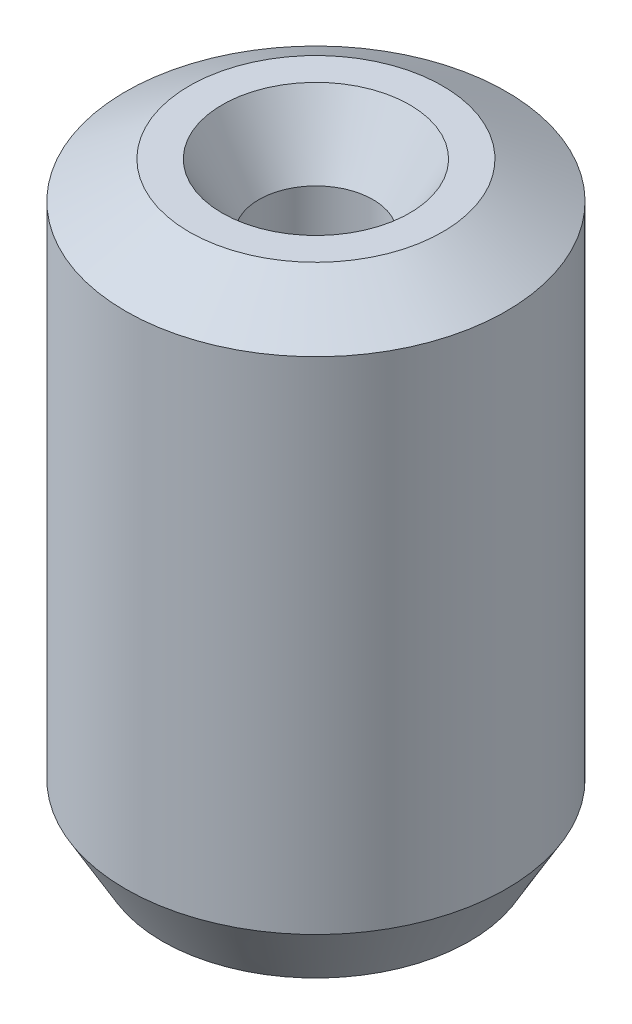
ISO-10303-21;
HEADER;
FILE_DESCRIPTION(('STEP AP214'),'2;1');
FILE_NAME('part.step','',(''),(''),'','','');
FILE_SCHEMA(('AUTOMOTIVE_DESIGN { 1 0 10303 214 1 1 1 1 }'));
ENDSEC;
DATA;
#1=APPLICATION_CONTEXT('core data for automotive mechanical design processes');
#2=APPLICATION_PROTOCOL_DEFINITION('international standard','automotive_design',2000,#1);
#3=PRODUCT_CONTEXT('',#1,'mechanical');
#4=PRODUCT('Part','Part','',(#3));
#5=PRODUCT_RELATED_PRODUCT_CATEGORY('part','',(#4));
#6=PRODUCT_DEFINITION_FORMATION('','',#4);
#7=PRODUCT_DEFINITION_CONTEXT('part definition',#1,'design');
#8=PRODUCT_DEFINITION('design','',#6,#7);
#9=PRODUCT_DEFINITION_SHAPE('','',#8);
#10=(LENGTH_UNIT() NAMED_UNIT(*) SI_UNIT(.MILLI.,.METRE.));
#11=(NAMED_UNIT(*) PLANE_ANGLE_UNIT() SI_UNIT($,.RADIAN.));
#12=(NAMED_UNIT(*) SI_UNIT($,.STERADIAN.) SOLID_ANGLE_UNIT());
#13=UNCERTAINTY_MEASURE_WITH_UNIT(LENGTH_MEASURE(1.E-05),#10,'distance_accuracy_value','');
#14=(GEOMETRIC_REPRESENTATION_CONTEXT(3) GLOBAL_UNCERTAINTY_ASSIGNED_CONTEXT((#13)) GLOBAL_UNIT_ASSIGNED_CONTEXT((#10,
#11,#12)) REPRESENTATION_CONTEXT('',''));
#15=CARTESIAN_POINT('',(0.,0.,0.));
#16=DIRECTION('',(0.,0.,1.));
#17=DIRECTION('',(1.,0.,0.));
#18=AXIS2_PLACEMENT_3D('',#15,#16,#17);
#19=CARTESIAN_POINT('',(0.,15.78622708105,0.));
#20=DIRECTION('',(0.,-1.,0.));
#21=DIRECTION('',(0.,0.,-1.));
#22=AXIS2_PLACEMENT_3D('',#19,#20,#21);
#23=CYLINDRICAL_SURFACE('',#22,5.);
#24=CARTESIAN_POINT('',(0.,1.67307131038867,0.));
#25=DIRECTION('',(0.,1.,0.));
#26=DIRECTION('',(0.,0.,1.));
#27=AXIS2_PLACEMENT_3D('',#24,#25,#26);
#28=CIRCLE('',#27,5.);
#29=CARTESIAN_POINT('',(0.,1.67307131038867,5.));
#30=VERTEX_POINT('',#29);
#31=EDGE_CURVE('E10',#30,#30,#28,.T.);
#32=ORIENTED_EDGE('',*,*,#31,.T.);
#33=EDGE_LOOP('',(#32));
#34=FACE_BOUND('',#33,.T.);
#35=CARTESIAN_POINT('',(0.,14.8202789096236,0.));
#36=DIRECTION('',(0.,1.,0.));
#37=DIRECTION('',(0.,0.,1.));
#38=AXIS2_PLACEMENT_3D('',#35,#36,#37);
#39=CIRCLE('',#38,5.);
#40=CARTESIAN_POINT('',(0.,14.8202789096236,5.));
#41=VERTEX_POINT('',#40);
#42=EDGE_CURVE('E50',#41,#41,#39,.F.);
#43=ORIENTED_EDGE('',*,*,#42,.T.);
#44=EDGE_LOOP('',(#43));
#45=FACE_BOUND('',#44,.T.);
#46=ADVANCED_FACE('F39',(#34,#45),#23,.T.);
#47=CARTESIAN_POINT('',(0.,15.78622708105,0.));
#48=DIRECTION('',(0.,1.,0.));
#49=DIRECTION('',(0.,0.,1.));
#50=AXIS2_PLACEMENT_3D('',#47,#48,#49);
#51=PLANE('',#50);
#52=CARTESIAN_POINT('',(0.,15.78622708105,0.));
#53=DIRECTION('',(0.,1.,0.));
#54=DIRECTION('',(0.,0.,1.));
#55=AXIS2_PLACEMENT_3D('',#52,#53,#54);
#56=CIRCLE('',#55,2.46448687163385);
#57=CARTESIAN_POINT('',(0.,15.78622708105,2.46448687163385));
#58=VERTEX_POINT('',#57);
#59=EDGE_CURVE('E58',#58,#58,#56,.F.);
#60=ORIENTED_EDGE('',*,*,#59,.T.);
#61=EDGE_LOOP('',(#60));
#62=FACE_BOUND('',#61,.T.);
#63=CARTESIAN_POINT('',(0.,15.78622708105,0.));
#64=DIRECTION('',(0.,1.,0.));
#65=DIRECTION('',(0.,0.,1.));
#66=AXIS2_PLACEMENT_3D('',#63,#64,#65);
#67=CIRCLE('',#66,3.32692868961133);
#68=CARTESIAN_POINT('',(0.,15.78622708105,3.32692868961133));
#69=VERTEX_POINT('',#68);
#70=EDGE_CURVE('E61',#69,#69,#67,.T.);
#71=ORIENTED_EDGE('',*,*,#70,.T.);
#72=EDGE_LOOP('',(#71));
#73=FACE_BOUND('',#72,.T.);
#74=ADVANCED_FACE('F88',(#62,#73),#51,.T.);
#75=CARTESIAN_POINT('',(0.,0.,0.));
#76=DIRECTION('',(0.,1.,0.));
#77=DIRECTION('',(0.,0.,1.));
#78=AXIS2_PLACEMENT_3D('',#75,#76,#77);
#79=PLANE('',#78);
#80=CARTESIAN_POINT('',(0.,0.,0.));
#81=DIRECTION('',(0.,1.,0.));
#82=DIRECTION('',(0.,0.,1.));
#83=AXIS2_PLACEMENT_3D('',#80,#81,#82);
#84=CIRCLE('',#83,3.17161001059617);
#85=CARTESIAN_POINT('',(0.,0.,3.17161001059617));
#86=VERTEX_POINT('',#85);
#87=EDGE_CURVE('E51',#86,#86,#84,.T.);
#88=ORIENTED_EDGE('',*,*,#87,.T.);
#89=EDGE_LOOP('',(#88));
#90=FACE_BOUND('',#89,.T.);
#91=CARTESIAN_POINT('',(0.,0.,0.));
#92=DIRECTION('',(0.,1.,0.));
#93=DIRECTION('',(0.,0.,1.));
#94=AXIS2_PLACEMENT_3D('',#91,#92,#93);
#95=CIRCLE('',#94,4.03405182857365);
#96=CARTESIAN_POINT('',(0.,0.,4.03405182857365));
#97=VERTEX_POINT('',#96);
#98=EDGE_CURVE('E54',#97,#97,#95,.F.);
#99=ORIENTED_EDGE('',*,*,#98,.T.);
#100=EDGE_LOOP('',(#99));
#101=FACE_BOUND('',#100,.T.);
#102=ADVANCED_FACE('F83',(#90,#101),#79,.F.);
#103=CARTESIAN_POINT('',(0.,15.78622708105,0.));
#104=DIRECTION('',(0.,-1.,0.));
#105=DIRECTION('',(0.,0.,-1.));
#106=AXIS2_PLACEMENT_3D('',#103,#104,#105);
#107=CYLINDRICAL_SURFACE('',#106,1.49853870020751);
#108=CARTESIAN_POINT('',(0.,14.1131557706613,0.));
#109=DIRECTION('',(0.,1.,0.));
#110=DIRECTION('',(0.,0.,1.));
#111=AXIS2_PLACEMENT_3D('',#108,#109,#110);
#112=CIRCLE('',#111,1.49853870020751);
#113=CARTESIAN_POINT('',(0.,14.1131557706613,1.49853870020751));
#114=VERTEX_POINT('',#113);
#115=EDGE_CURVE('E67',#114,#114,#112,.T.);
#116=ORIENTED_EDGE('',*,*,#115,.T.);
#117=EDGE_LOOP('',(#116));
#118=FACE_BOUND('',#117,.T.);
#119=CARTESIAN_POINT('',(0.,0.965948171426348,0.));
#120=DIRECTION('',(0.,1.,0.));
#121=DIRECTION('',(0.,0.,1.));
#122=AXIS2_PLACEMENT_3D('',#119,#120,#121);
#123=CIRCLE('',#122,1.49853870020751);
#124=CARTESIAN_POINT('',(0.,0.965948171426348,1.49853870020751));
#125=VERTEX_POINT('',#124);
#126=EDGE_CURVE('E69',#125,#125,#123,.F.);
#127=ORIENTED_EDGE('',*,*,#126,.T.);
#128=EDGE_LOOP('',(#127));
#129=FACE_BOUND('',#128,.T.);
#130=ADVANCED_FACE('F71',(#118,#129),#107,.F.);
#131=CARTESIAN_POINT('',(0.,14.1131557706613,0.));
#132=DIRECTION('',(0.,1.,0.));
#133=DIRECTION('',(0.,0.,1.));
#134=AXIS2_PLACEMENT_3D('',#131,#132,#133);
#135=CONICAL_SURFACE('',#134,1.49853870020751,0.523598775598302);
#136=ORIENTED_EDGE('',*,*,#59,.F.);
#137=EDGE_LOOP('',(#136));
#138=FACE_BOUND('',#137,.T.);
#139=ORIENTED_EDGE('',*,*,#115,.F.);
#140=EDGE_LOOP('',(#139));
#141=FACE_BOUND('',#140,.T.);
#142=ADVANCED_FACE('F77',(#138,#141),#135,.F.);
#143=CARTESIAN_POINT('',(0.,0.,0.));
#144=DIRECTION('',(0.,-1.,0.));
#145=DIRECTION('',(0.,0.,-1.));
#146=AXIS2_PLACEMENT_3D('',#143,#144,#145);
#147=CONICAL_SURFACE('',#146,3.17161001059617,1.04719755119659);
#148=ORIENTED_EDGE('',*,*,#126,.F.);
#149=EDGE_LOOP('',(#148));
#150=FACE_BOUND('',#149,.T.);
#151=ORIENTED_EDGE('',*,*,#87,.F.);
#152=EDGE_LOOP('',(#151));
#153=FACE_BOUND('',#152,.T.);
#154=ADVANCED_FACE('F73',(#150,#153),#147,.F.);
#155=CARTESIAN_POINT('',(0.,1.67307131038867,0.));
#156=DIRECTION('',(0.,1.,0.));
#157=DIRECTION('',(0.,0.,1.));
#158=AXIS2_PLACEMENT_3D('',#155,#156,#157);
#159=CONICAL_SURFACE('',#158,5.,0.523598775598303);
#160=ORIENTED_EDGE('',*,*,#98,.F.);
#161=EDGE_LOOP('',(#160));
#162=FACE_BOUND('',#161,.T.);
#163=ORIENTED_EDGE('',*,*,#31,.F.);
#164=EDGE_LOOP('',(#163));
#165=FACE_BOUND('',#164,.T.);
#166=ADVANCED_FACE('F76',(#162,#165),#159,.T.);
#167=CARTESIAN_POINT('',(0.,15.78622708105,0.));
#168=DIRECTION('',(0.,-1.,0.));
#169=DIRECTION('',(0.,0.,-1.));
#170=AXIS2_PLACEMENT_3D('',#167,#168,#169);
#171=CONICAL_SURFACE('',#170,3.32692868961133,1.04719755119659);
#172=ORIENTED_EDGE('',*,*,#42,.F.);
#173=EDGE_LOOP('',(#172));
#174=FACE_BOUND('',#173,.T.);
#175=ORIENTED_EDGE('',*,*,#70,.F.);
#176=EDGE_LOOP('',(#175));
#177=FACE_BOUND('',#176,.T.);
#178=ADVANCED_FACE('F45',(#174,#177),#171,.T.);
#179=CLOSED_SHELL('',(#46,#74,#102,#130,#142,#154,#166,#178));
#180=MANIFOLD_SOLID_BREP('B2',#179);
#181=ADVANCED_BREP_SHAPE_REPRESENTATION('',(#18,#180),#14);
#182=SHAPE_DEFINITION_REPRESENTATION(#9,#181);
ENDSEC;
END-ISO-10303-21;
